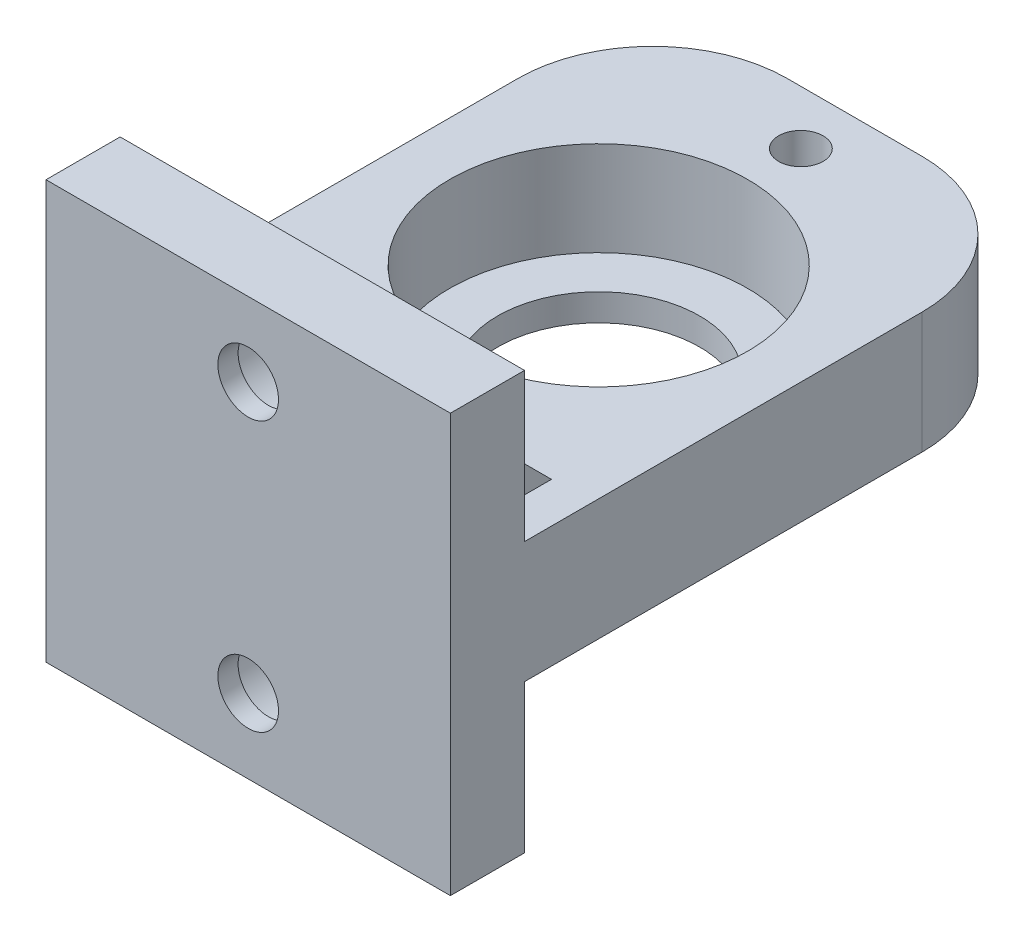
ISO-10303-21;
HEADER;
FILE_DESCRIPTION(('STEP AP214'),'2;1');
FILE_NAME('part.step','',(''),(''),'','','');
FILE_SCHEMA(('AUTOMOTIVE_DESIGN { 1 0 10303 214 1 1 1 1 }'));
ENDSEC;
DATA;
#1=APPLICATION_CONTEXT('core data for automotive mechanical design processes');
#2=APPLICATION_PROTOCOL_DEFINITION('international standard','automotive_design',2000,#1);
#3=PRODUCT_CONTEXT('',#1,'mechanical');
#4=PRODUCT('Part','Part','',(#3));
#5=PRODUCT_RELATED_PRODUCT_CATEGORY('part','',(#4));
#6=PRODUCT_DEFINITION_FORMATION('','',#4);
#7=PRODUCT_DEFINITION_CONTEXT('part definition',#1,'design');
#8=PRODUCT_DEFINITION('design','',#6,#7);
#9=PRODUCT_DEFINITION_SHAPE('','',#8);
#10=(LENGTH_UNIT() NAMED_UNIT(*) SI_UNIT(.MILLI.,.METRE.));
#11=(NAMED_UNIT(*) PLANE_ANGLE_UNIT() SI_UNIT($,.RADIAN.));
#12=(NAMED_UNIT(*) SI_UNIT($,.STERADIAN.) SOLID_ANGLE_UNIT());
#13=UNCERTAINTY_MEASURE_WITH_UNIT(LENGTH_MEASURE(1.E-05),#10,'distance_accuracy_value','');
#14=(GEOMETRIC_REPRESENTATION_CONTEXT(3) GLOBAL_UNCERTAINTY_ASSIGNED_CONTEXT((#13)) GLOBAL_UNIT_ASSIGNED_CONTEXT((#10,
#11,#12)) REPRESENTATION_CONTEXT('',''));
#15=CARTESIAN_POINT('',(0.,0.,0.));
#16=DIRECTION('',(0.,0.,1.));
#17=DIRECTION('',(1.,0.,0.));
#18=AXIS2_PLACEMENT_3D('',#15,#16,#17);
#19=CARTESIAN_POINT('',(15.,9.,-22.5));
#20=DIRECTION('',(-1.,0.,0.));
#21=DIRECTION('',(0.,0.,1.));
#22=AXIS2_PLACEMENT_3D('',#19,#20,#21);
#23=PLANE('',#22);
#24=DIRECTION('',(0.,-1.,0.));
#25=VECTOR('',#24,1.);
#26=CARTESIAN_POINT('',(15.,9.,22.5));
#27=LINE('',#26,#25);
#28=CARTESIAN_POINT('',(15.,20.,22.5));
#29=VERTEX_POINT('',#28);
#30=CARTESIAN_POINT('',(15.,-11.,22.5));
#31=VERTEX_POINT('',#30);
#32=EDGE_CURVE('E348',#29,#31,#27,.T.);
#33=ORIENTED_EDGE('',*,*,#32,.T.);
#34=DIRECTION('',(0.,0.,1.));
#35=VECTOR('',#34,1.);
#36=CARTESIAN_POINT('',(15.,-11.,17.));
#37=LINE('',#36,#35);
#38=CARTESIAN_POINT('',(15.,-11.,17.));
#39=VERTEX_POINT('',#38);
#40=EDGE_CURVE('E321',#39,#31,#37,.T.);
#41=ORIENTED_EDGE('',*,*,#40,.F.);
#42=DIRECTION('',(0.,1.,0.));
#43=VECTOR('',#42,1.);
#44=CARTESIAN_POINT('',(15.,0.,17.));
#45=LINE('',#44,#43);
#46=CARTESIAN_POINT('',(15.,0.,17.));
#47=VERTEX_POINT('',#46);
#48=EDGE_CURVE('E312',#39,#47,#45,.T.);
#49=ORIENTED_EDGE('',*,*,#48,.T.);
#50=DIRECTION('',(0.,0.,-1.));
#51=VECTOR('',#50,1.);
#52=CARTESIAN_POINT('',(15.,0.,-22.5));
#53=LINE('',#52,#51);
#54=CARTESIAN_POINT('',(15.,0.,-12.5));
#55=VERTEX_POINT('',#54);
#56=EDGE_CURVE('E336',#47,#55,#53,.T.);
#57=ORIENTED_EDGE('',*,*,#56,.T.);
#58=DIRECTION('',(0.,-1.,0.));
#59=VECTOR('',#58,1.);
#60=CARTESIAN_POINT('',(15.,9.,-12.5));
#61=LINE('',#60,#59);
#62=CARTESIAN_POINT('',(15.,9.,-12.5));
#63=VERTEX_POINT('',#62);
#64=EDGE_CURVE('E369',#55,#63,#61,.F.);
#65=ORIENTED_EDGE('',*,*,#64,.T.);
#66=DIRECTION('',(0.,0.,-1.));
#67=VECTOR('',#66,1.);
#68=CARTESIAN_POINT('',(15.,9.,-22.5));
#69=LINE('',#68,#67);
#70=CARTESIAN_POINT('',(15.,9.,17.));
#71=VERTEX_POINT('',#70);
#72=EDGE_CURVE('E339',#71,#63,#69,.T.);
#73=ORIENTED_EDGE('',*,*,#72,.F.);
#74=DIRECTION('',(0.,-1.,0.));
#75=VECTOR('',#74,1.);
#76=CARTESIAN_POINT('',(15.,20.,17.));
#77=LINE('',#76,#75);
#78=CARTESIAN_POINT('',(15.,20.,17.));
#79=VERTEX_POINT('',#78);
#80=EDGE_CURVE('E253',#79,#71,#77,.T.);
#81=ORIENTED_EDGE('',*,*,#80,.F.);
#82=DIRECTION('',(0.,0.,-1.));
#83=VECTOR('',#82,1.);
#84=CARTESIAN_POINT('',(15.,20.,17.));
#85=LINE('',#84,#83);
#86=EDGE_CURVE('E244',#29,#79,#85,.T.);
#87=ORIENTED_EDGE('',*,*,#86,.F.);
#88=EDGE_LOOP('',(#33,#41,#49,#57,#65,#73,#81,#87));
#89=FACE_BOUND('',#88,.T.);
#90=ADVANCED_FACE('F41',(#89),#23,.F.);
#91=CARTESIAN_POINT('',(-15.,9.,-22.5));
#92=DIRECTION('',(0.,0.,1.));
#93=DIRECTION('',(1.,0.,0.));
#94=AXIS2_PLACEMENT_3D('',#91,#92,#93);
#95=PLANE('',#94);
#96=DIRECTION('',(-1.,0.,0.));
#97=VECTOR('',#96,1.);
#98=CARTESIAN_POINT('',(-15.,9.,-22.5));
#99=LINE('',#98,#97);
#100=CARTESIAN_POINT('',(4.99999999999999,9.,-22.5));
#101=VERTEX_POINT('',#100);
#102=CARTESIAN_POINT('',(-5.,9.,-22.5));
#103=VERTEX_POINT('',#102);
#104=EDGE_CURVE('E341',#101,#103,#99,.T.);
#105=ORIENTED_EDGE('',*,*,#104,.F.);
#106=DIRECTION('',(0.,-1.,0.));
#107=VECTOR('',#106,1.);
#108=CARTESIAN_POINT('',(4.99999999999999,9.,-22.5));
#109=LINE('',#108,#107);
#110=CARTESIAN_POINT('',(4.99999999999999,0.,-22.5));
#111=VERTEX_POINT('',#110);
#112=EDGE_CURVE('E361',#101,#111,#109,.T.);
#113=ORIENTED_EDGE('',*,*,#112,.T.);
#114=DIRECTION('',(-1.,0.,0.));
#115=VECTOR('',#114,1.);
#116=CARTESIAN_POINT('',(-15.,0.,-22.5));
#117=LINE('',#116,#115);
#118=CARTESIAN_POINT('',(-5.,0.,-22.5));
#119=VERTEX_POINT('',#118);
#120=EDGE_CURVE('E350',#111,#119,#117,.T.);
#121=ORIENTED_EDGE('',*,*,#120,.T.);
#122=DIRECTION('',(0.,-1.,0.));
#123=VECTOR('',#122,1.);
#124=CARTESIAN_POINT('',(-5.,9.,-22.5));
#125=LINE('',#124,#123);
#126=EDGE_CURVE('E359',#119,#103,#125,.F.);
#127=ORIENTED_EDGE('',*,*,#126,.T.);
#128=EDGE_LOOP('',(#105,#113,#121,#127));
#129=FACE_BOUND('',#128,.T.);
#130=ADVANCED_FACE('F425',(#129),#95,.F.);
#131=CARTESIAN_POINT('',(-15.,9.,-22.5));
#132=DIRECTION('',(1.,0.,0.));
#133=DIRECTION('',(0.,0.,-1.));
#134=AXIS2_PLACEMENT_3D('',#131,#132,#133);
#135=PLANE('',#134);
#136=DIRECTION('',(0.,0.,1.));
#137=VECTOR('',#136,1.);
#138=CARTESIAN_POINT('',(-15.,9.,-22.5));
#139=LINE('',#138,#137);
#140=CARTESIAN_POINT('',(-15.,9.,-12.5));
#141=VERTEX_POINT('',#140);
#142=CARTESIAN_POINT('',(-15.,9.,17.));
#143=VERTEX_POINT('',#142);
#144=EDGE_CURVE('E345',#141,#143,#139,.T.);
#145=ORIENTED_EDGE('',*,*,#144,.F.);
#146=DIRECTION('',(0.,-1.,0.));
#147=VECTOR('',#146,1.);
#148=CARTESIAN_POINT('',(-15.,9.,-12.5));
#149=LINE('',#148,#147);
#150=CARTESIAN_POINT('',(-15.,0.,-12.5));
#151=VERTEX_POINT('',#150);
#152=EDGE_CURVE('E376',#141,#151,#149,.T.);
#153=ORIENTED_EDGE('',*,*,#152,.T.);
#154=DIRECTION('',(0.,0.,1.));
#155=VECTOR('',#154,1.);
#156=CARTESIAN_POINT('',(-15.,0.,-22.5));
#157=LINE('',#156,#155);
#158=CARTESIAN_POINT('',(-15.,0.,17.));
#159=VERTEX_POINT('',#158);
#160=EDGE_CURVE('E342',#151,#159,#157,.T.);
#161=ORIENTED_EDGE('',*,*,#160,.T.);
#162=DIRECTION('',(0.,-1.,0.));
#163=VECTOR('',#162,1.);
#164=CARTESIAN_POINT('',(-15.,0.,17.));
#165=LINE('',#164,#163);
#166=CARTESIAN_POINT('',(-15.,-11.,17.));
#167=VERTEX_POINT('',#166);
#168=EDGE_CURVE('E307',#159,#167,#165,.T.);
#169=ORIENTED_EDGE('',*,*,#168,.T.);
#170=DIRECTION('',(0.,0.,1.));
#171=VECTOR('',#170,1.);
#172=CARTESIAN_POINT('',(-15.,-11.,17.));
#173=LINE('',#172,#171);
#174=CARTESIAN_POINT('',(-15.,-11.,22.5));
#175=VERTEX_POINT('',#174);
#176=EDGE_CURVE('E318',#167,#175,#173,.T.);
#177=ORIENTED_EDGE('',*,*,#176,.T.);
#178=DIRECTION('',(0.,-1.,0.));
#179=VECTOR('',#178,1.);
#180=CARTESIAN_POINT('',(-15.,9.,22.5));
#181=LINE('',#180,#179);
#182=CARTESIAN_POINT('',(-15.,20.,22.5));
#183=VERTEX_POINT('',#182);
#184=EDGE_CURVE('E357',#183,#175,#181,.T.);
#185=ORIENTED_EDGE('',*,*,#184,.F.);
#186=DIRECTION('',(0.,0.,1.));
#187=VECTOR('',#186,1.);
#188=CARTESIAN_POINT('',(-15.,20.,17.));
#189=LINE('',#188,#187);
#190=CARTESIAN_POINT('',(-15.,20.,17.));
#191=VERTEX_POINT('',#190);
#192=EDGE_CURVE('E237',#191,#183,#189,.T.);
#193=ORIENTED_EDGE('',*,*,#192,.F.);
#194=DIRECTION('',(0.,-1.,0.));
#195=VECTOR('',#194,1.);
#196=CARTESIAN_POINT('',(-15.,20.,17.));
#197=LINE('',#196,#195);
#198=EDGE_CURVE('E248',#191,#143,#197,.T.);
#199=ORIENTED_EDGE('',*,*,#198,.T.);
#200=EDGE_LOOP('',(#145,#153,#161,#169,#177,#185,#193,#199));
#201=FACE_BOUND('',#200,.T.);
#202=ADVANCED_FACE('F433',(#201),#135,.F.);
#203=CARTESIAN_POINT('',(-15.,9.,22.5));
#204=DIRECTION('',(0.,0.,-1.));
#205=DIRECTION('',(-1.,0.,0.));
#206=AXIS2_PLACEMENT_3D('',#203,#204,#205);
#207=PLANE('',#206);
#208=CARTESIAN_POINT('',(0.,14.5,22.5));
#209=DIRECTION('',(0.,0.,-1.));
#210=DIRECTION('',(-1.,0.,0.));
#211=AXIS2_PLACEMENT_3D('',#208,#209,#210);
#212=CIRCLE('',#211,2.25);
#213=CARTESIAN_POINT('',(-2.25,14.5,22.5));
#214=VERTEX_POINT('',#213);
#215=EDGE_CURVE('E210',#214,#214,#212,.T.);
#216=ORIENTED_EDGE('',*,*,#215,.T.);
#217=EDGE_LOOP('',(#216));
#218=FACE_BOUND('',#217,.T.);
#219=DIRECTION('',(1.,0.,0.));
#220=VECTOR('',#219,1.);
#221=CARTESIAN_POINT('',(-15.,-11.,22.5));
#222=LINE('',#221,#220);
#223=EDGE_CURVE('E306',#175,#31,#222,.T.);
#224=ORIENTED_EDGE('',*,*,#223,.T.);
#225=ORIENTED_EDGE('',*,*,#32,.F.);
#226=DIRECTION('',(1.,0.,0.));
#227=VECTOR('',#226,1.);
#228=CARTESIAN_POINT('',(-15.,20.,22.5));
#229=LINE('',#228,#227);
#230=EDGE_CURVE('E240',#183,#29,#229,.T.);
#231=ORIENTED_EDGE('',*,*,#230,.F.);
#232=ORIENTED_EDGE('',*,*,#184,.T.);
#233=EDGE_LOOP('',(#224,#225,#231,#232));
#234=FACE_BOUND('',#233,.T.);
#235=CARTESIAN_POINT('',(0.,-5.5,22.5));
#236=DIRECTION('',(0.,0.,-1.));
#237=DIRECTION('',(-1.,0.,0.));
#238=AXIS2_PLACEMENT_3D('',#235,#236,#237);
#239=CIRCLE('',#238,2.25);
#240=CARTESIAN_POINT('',(-2.25,-5.5,22.5));
#241=VERTEX_POINT('',#240);
#242=EDGE_CURVE('E303',#241,#241,#239,.T.);
#243=ORIENTED_EDGE('',*,*,#242,.T.);
#244=EDGE_LOOP('',(#243));
#245=FACE_BOUND('',#244,.T.);
#246=ADVANCED_FACE('F485',(#218,#234,#245),#207,.F.);
#247=CARTESIAN_POINT('',(0.,9.,0.));
#248=DIRECTION('',(0.,1.,0.));
#249=DIRECTION('',(0.,0.,1.));
#250=AXIS2_PLACEMENT_3D('',#247,#248,#249);
#251=PLANE('',#250);
#252=DIRECTION('',(0.,0.,-1.));
#253=VECTOR('',#252,1.);
#254=CARTESIAN_POINT('',(12.,9.,0.));
#255=LINE('',#254,#253);
#256=CARTESIAN_POINT('',(12.,9.,17.));
#257=VERTEX_POINT('',#256);
#258=CARTESIAN_POINT('',(12.,9.,12.));
#259=VERTEX_POINT('',#258);
#260=EDGE_CURVE('E218',#257,#259,#255,.T.);
#261=ORIENTED_EDGE('',*,*,#260,.F.);
#262=DIRECTION('',(-1.,0.,0.));
#263=VECTOR('',#262,1.);
#264=CARTESIAN_POINT('',(-15.,9.,17.));
#265=LINE('',#264,#263);
#266=EDGE_CURVE('E241',#71,#257,#265,.T.);
#267=ORIENTED_EDGE('',*,*,#266,.F.);
#268=ORIENTED_EDGE('',*,*,#72,.T.);
#269=CARTESIAN_POINT('',(4.99999999999999,9.,-12.5));
#270=DIRECTION('',(0.,1.,0.));
#271=DIRECTION('',(0.,0.,1.));
#272=AXIS2_PLACEMENT_3D('',#269,#270,#271);
#273=CIRCLE('',#272,10.);
#274=EDGE_CURVE('E374',#63,#101,#273,.T.);
#275=ORIENTED_EDGE('',*,*,#274,.T.);
#276=ORIENTED_EDGE('',*,*,#104,.T.);
#277=CARTESIAN_POINT('',(-5.,9.,-12.5));
#278=DIRECTION('',(0.,1.,0.));
#279=DIRECTION('',(0.,0.,1.));
#280=AXIS2_PLACEMENT_3D('',#277,#278,#279);
#281=CIRCLE('',#280,10.);
#282=EDGE_CURVE('E372',#103,#141,#281,.T.);
#283=ORIENTED_EDGE('',*,*,#282,.T.);
#284=ORIENTED_EDGE('',*,*,#144,.T.);
#285=CARTESIAN_POINT('',(-12.,9.,17.));
#286=VERTEX_POINT('',#285);
#287=EDGE_CURVE('E236',#286,#143,#265,.T.);
#288=ORIENTED_EDGE('',*,*,#287,.F.);
#289=DIRECTION('',(0.,0.,1.));
#290=VECTOR('',#289,1.);
#291=CARTESIAN_POINT('',(-12.,9.,0.));
#292=LINE('',#291,#290);
#293=CARTESIAN_POINT('',(-12.,9.,12.));
#294=VERTEX_POINT('',#293);
#295=EDGE_CURVE('E230',#294,#286,#292,.T.);
#296=ORIENTED_EDGE('',*,*,#295,.F.);
#297=DIRECTION('',(1.,0.,0.));
#298=VECTOR('',#297,1.);
#299=CARTESIAN_POINT('',(0.,9.,12.));
#300=LINE('',#299,#298);
#301=CARTESIAN_POINT('',(-7.99999999999999,9.,12.));
#302=VERTEX_POINT('',#301);
#303=EDGE_CURVE('E233',#302,#294,#300,.F.);
#304=ORIENTED_EDGE('',*,*,#303,.F.);
#305=DIRECTION('',(0.,0.,1.));
#306=VECTOR('',#305,1.);
#307=CARTESIAN_POINT('',(-7.99999999999999,9.,0.));
#308=LINE('',#307,#306);
#309=CARTESIAN_POINT('',(-7.99999999999999,9.,17.));
#310=VERTEX_POINT('',#309);
#311=EDGE_CURVE('E225',#302,#310,#308,.T.);
#312=ORIENTED_EDGE('',*,*,#311,.T.);
#313=CARTESIAN_POINT('',(7.99999999999999,9.,17.));
#314=VERTEX_POINT('',#313);
#315=EDGE_CURVE('E250',#314,#310,#265,.T.);
#316=ORIENTED_EDGE('',*,*,#315,.F.);
#317=DIRECTION('',(0.,0.,-1.));
#318=VECTOR('',#317,1.);
#319=CARTESIAN_POINT('',(7.99999999999999,9.,0.));
#320=LINE('',#319,#318);
#321=CARTESIAN_POINT('',(7.99999999999999,9.,12.));
#322=VERTEX_POINT('',#321);
#323=EDGE_CURVE('E61',#314,#322,#320,.T.);
#324=ORIENTED_EDGE('',*,*,#323,.T.);
#325=DIRECTION('',(-1.,0.,0.));
#326=VECTOR('',#325,1.);
#327=CARTESIAN_POINT('',(0.,9.,12.));
#328=LINE('',#327,#326);
#329=EDGE_CURVE('E56',#259,#322,#328,.T.);
#330=ORIENTED_EDGE('',*,*,#329,.F.);
#331=EDGE_LOOP('',(#261,#267,#268,#275,#276,#283,#284,#288,#296,#304,#312,#316,#324,#330));
#332=FACE_BOUND('',#331,.T.);
#333=CARTESIAN_POINT('',(0.,9.,-18.5));
#334=DIRECTION('',(0.,1.,0.));
#335=DIRECTION('',(0.,0.,1.));
#336=AXIS2_PLACEMENT_3D('',#333,#334,#335);
#337=CIRCLE('',#336,1.65);
#338=CARTESIAN_POINT('',(0.,9.,-16.85));
#339=VERTEX_POINT('',#338);
#340=EDGE_CURVE('E256',#339,#339,#337,.T.);
#341=ORIENTED_EDGE('',*,*,#340,.F.);
#342=EDGE_LOOP('',(#341));
#343=FACE_BOUND('',#342,.T.);
#344=CARTESIAN_POINT('',(0.,9.,11.5));
#345=DIRECTION('',(0.,1.,0.));
#346=DIRECTION('',(0.,0.,1.));
#347=AXIS2_PLACEMENT_3D('',#344,#345,#346);
#348=CIRCLE('',#347,1.65);
#349=CARTESIAN_POINT('',(0.,9.,13.15));
#350=VERTEX_POINT('',#349);
#351=EDGE_CURVE('E262',#350,#350,#348,.T.);
#352=ORIENTED_EDGE('',*,*,#351,.F.);
#353=EDGE_LOOP('',(#352));
#354=FACE_BOUND('',#353,.T.);
#355=CARTESIAN_POINT('',(0.,9.,-3.49999999999999));
#356=DIRECTION('',(0.,1.,0.));
#357=DIRECTION('',(0.,0.,1.));
#358=AXIS2_PLACEMENT_3D('',#355,#356,#357);
#359=CIRCLE('',#358,11.05);
#360=CARTESIAN_POINT('',(0.,9.,7.55000000000001));
#361=VERTEX_POINT('',#360);
#362=EDGE_CURVE('E330',#361,#361,#359,.T.);
#363=ORIENTED_EDGE('',*,*,#362,.F.);
#364=EDGE_LOOP('',(#363));
#365=FACE_BOUND('',#364,.T.);
#366=ADVANCED_FACE('F404',(#332,#343,#354,#365),#251,.T.);
#367=CARTESIAN_POINT('',(0.,0.,0.));
#368=DIRECTION('',(0.,1.,0.));
#369=DIRECTION('',(0.,0.,1.));
#370=AXIS2_PLACEMENT_3D('',#367,#368,#369);
#371=PLANE('',#370);
#372=DIRECTION('',(0.,0.,-1.));
#373=VECTOR('',#372,1.);
#374=CARTESIAN_POINT('',(12.,0.,0.));
#375=LINE('',#374,#373);
#376=CARTESIAN_POINT('',(12.,0.,17.));
#377=VERTEX_POINT('',#376);
#378=CARTESIAN_POINT('',(12.,0.,12.));
#379=VERTEX_POINT('',#378);
#380=EDGE_CURVE('E277',#377,#379,#375,.T.);
#381=ORIENTED_EDGE('',*,*,#380,.T.);
#382=DIRECTION('',(1.,0.,0.));
#383=VECTOR('',#382,1.);
#384=CARTESIAN_POINT('',(0.,0.,12.));
#385=LINE('',#384,#383);
#386=CARTESIAN_POINT('',(7.99999999999999,0.,12.));
#387=VERTEX_POINT('',#386);
#388=EDGE_CURVE('E279',#379,#387,#385,.F.);
#389=ORIENTED_EDGE('',*,*,#388,.T.);
#390=DIRECTION('',(0.,0.,-1.));
#391=VECTOR('',#390,1.);
#392=CARTESIAN_POINT('',(7.99999999999999,0.,0.));
#393=LINE('',#392,#391);
#394=CARTESIAN_POINT('',(7.99999999999999,0.,17.));
#395=VERTEX_POINT('',#394);
#396=EDGE_CURVE('E272',#395,#387,#393,.T.);
#397=ORIENTED_EDGE('',*,*,#396,.F.);
#398=DIRECTION('',(-1.,0.,0.));
#399=VECTOR('',#398,1.);
#400=CARTESIAN_POINT('',(-15.,0.,17.));
#401=LINE('',#400,#399);
#402=CARTESIAN_POINT('',(-7.99999999999999,0.,17.));
#403=VERTEX_POINT('',#402);
#404=EDGE_CURVE('E319',#395,#403,#401,.T.);
#405=ORIENTED_EDGE('',*,*,#404,.T.);
#406=DIRECTION('',(0.,0.,1.));
#407=VECTOR('',#406,1.);
#408=CARTESIAN_POINT('',(-7.99999999999999,0.,0.));
#409=LINE('',#408,#407);
#410=CARTESIAN_POINT('',(-7.99999999999999,0.,12.));
#411=VERTEX_POINT('',#410);
#412=EDGE_CURVE('E285',#411,#403,#409,.T.);
#413=ORIENTED_EDGE('',*,*,#412,.F.);
#414=DIRECTION('',(-1.,0.,0.));
#415=VECTOR('',#414,1.);
#416=CARTESIAN_POINT('',(0.,0.,12.));
#417=LINE('',#416,#415);
#418=CARTESIAN_POINT('',(-12.,0.,12.));
#419=VERTEX_POINT('',#418);
#420=EDGE_CURVE('E292',#411,#419,#417,.T.);
#421=ORIENTED_EDGE('',*,*,#420,.T.);
#422=DIRECTION('',(0.,0.,1.));
#423=VECTOR('',#422,1.);
#424=CARTESIAN_POINT('',(-12.,0.,0.));
#425=LINE('',#424,#423);
#426=CARTESIAN_POINT('',(-12.,0.,17.));
#427=VERTEX_POINT('',#426);
#428=EDGE_CURVE('E290',#419,#427,#425,.T.);
#429=ORIENTED_EDGE('',*,*,#428,.T.);
#430=EDGE_CURVE('E314',#427,#159,#401,.T.);
#431=ORIENTED_EDGE('',*,*,#430,.T.);
#432=ORIENTED_EDGE('',*,*,#160,.F.);
#433=CARTESIAN_POINT('',(-5.,0.,-12.5));
#434=DIRECTION('',(0.,1.,0.));
#435=DIRECTION('',(0.,0.,1.));
#436=AXIS2_PLACEMENT_3D('',#433,#434,#435);
#437=CIRCLE('',#436,10.);
#438=EDGE_CURVE('E364',#151,#119,#437,.F.);
#439=ORIENTED_EDGE('',*,*,#438,.T.);
#440=ORIENTED_EDGE('',*,*,#120,.F.);
#441=CARTESIAN_POINT('',(4.99999999999999,0.,-12.5));
#442=DIRECTION('',(0.,1.,0.));
#443=DIRECTION('',(0.,0.,1.));
#444=AXIS2_PLACEMENT_3D('',#441,#442,#443);
#445=CIRCLE('',#444,10.);
#446=EDGE_CURVE('E366',#111,#55,#445,.F.);
#447=ORIENTED_EDGE('',*,*,#446,.T.);
#448=ORIENTED_EDGE('',*,*,#56,.F.);
#449=EDGE_CURVE('E315',#47,#377,#401,.T.);
#450=ORIENTED_EDGE('',*,*,#449,.T.);
#451=EDGE_LOOP('',(#381,#389,#397,#405,#413,#421,#429,#431,#432,#439,#440,#447,#448,#450));
#452=FACE_BOUND('',#451,.T.);
#453=CARTESIAN_POINT('',(0.,0.,-3.49999999999999));
#454=DIRECTION('',(0.,1.,0.));
#455=DIRECTION('',(0.,0.,1.));
#456=AXIS2_PLACEMENT_3D('',#453,#454,#455);
#457=CIRCLE('',#456,7.5);
#458=CARTESIAN_POINT('',(0.,0.,4.00000000000001));
#459=VERTEX_POINT('',#458);
#460=EDGE_CURVE('E327',#459,#459,#457,.T.);
#461=ORIENTED_EDGE('',*,*,#460,.T.);
#462=EDGE_LOOP('',(#461));
#463=FACE_BOUND('',#462,.T.);
#464=ADVANCED_FACE('F473',(#452,#463),#371,.F.);
#465=CARTESIAN_POINT('',(0.,2.,-3.49999999999999));
#466=DIRECTION('',(0.,1.,0.));
#467=DIRECTION('',(0.,0.,1.));
#468=AXIS2_PLACEMENT_3D('',#465,#466,#467);
#469=CYLINDRICAL_SURFACE('',#468,11.05);
#470=ORIENTED_EDGE('',*,*,#362,.T.);
#471=EDGE_LOOP('',(#470));
#472=FACE_BOUND('',#471,.T.);
#473=CARTESIAN_POINT('',(0.,2.,-3.49999999999999));
#474=DIRECTION('',(0.,1.,0.));
#475=DIRECTION('',(0.,0.,1.));
#476=AXIS2_PLACEMENT_3D('',#473,#474,#475);
#477=CIRCLE('',#476,11.05);
#478=CARTESIAN_POINT('',(0.,2.,7.55000000000001));
#479=VERTEX_POINT('',#478);
#480=EDGE_CURVE('E333',#479,#479,#477,.T.);
#481=ORIENTED_EDGE('',*,*,#480,.F.);
#482=EDGE_LOOP('',(#481));
#483=FACE_BOUND('',#482,.T.);
#484=ADVANCED_FACE('F520',(#472,#483),#469,.F.);
#485=CARTESIAN_POINT('',(0.,2.,-3.49999999999999));
#486=DIRECTION('',(0.,1.,0.));
#487=DIRECTION('',(0.,0.,1.));
#488=AXIS2_PLACEMENT_3D('',#485,#486,#487);
#489=PLANE('',#488);
#490=CARTESIAN_POINT('',(0.,2.,-3.49999999999999));
#491=DIRECTION('',(0.,1.,0.));
#492=DIRECTION('',(0.,0.,1.));
#493=AXIS2_PLACEMENT_3D('',#490,#491,#492);
#494=CIRCLE('',#493,7.5);
#495=CARTESIAN_POINT('',(0.,2.,4.00000000000001));
#496=VERTEX_POINT('',#495);
#497=EDGE_CURVE('E324',#496,#496,#494,.T.);
#498=ORIENTED_EDGE('',*,*,#497,.F.);
#499=EDGE_LOOP('',(#498));
#500=FACE_BOUND('',#499,.T.);
#501=ORIENTED_EDGE('',*,*,#480,.T.);
#502=EDGE_LOOP('',(#501));
#503=FACE_BOUND('',#502,.T.);
#504=ADVANCED_FACE('F447',(#500,#503),#489,.T.);
#505=CARTESIAN_POINT('',(0.,0.,-3.49999999999999));
#506=DIRECTION('',(0.,1.,0.));
#507=DIRECTION('',(0.,0.,1.));
#508=AXIS2_PLACEMENT_3D('',#505,#506,#507);
#509=CYLINDRICAL_SURFACE('',#508,7.5);
#510=ORIENTED_EDGE('',*,*,#460,.F.);
#511=EDGE_LOOP('',(#510));
#512=FACE_BOUND('',#511,.T.);
#513=ORIENTED_EDGE('',*,*,#497,.T.);
#514=EDGE_LOOP('',(#513));
#515=FACE_BOUND('',#514,.T.);
#516=ADVANCED_FACE('F439',(#512,#515),#509,.F.);
#517=CARTESIAN_POINT('',(4.99999999999999,9.,-12.5));
#518=DIRECTION('',(0.,-1.,0.));
#519=DIRECTION('',(0.,0.,-1.));
#520=AXIS2_PLACEMENT_3D('',#517,#518,#519);
#521=CYLINDRICAL_SURFACE('',#520,10.);
#522=ORIENTED_EDGE('',*,*,#274,.F.);
#523=ORIENTED_EDGE('',*,*,#64,.F.);
#524=ORIENTED_EDGE('',*,*,#446,.F.);
#525=ORIENTED_EDGE('',*,*,#112,.F.);
#526=EDGE_LOOP('',(#522,#523,#524,#525));
#527=FACE_BOUND('',#526,.T.);
#528=ADVANCED_FACE('F437',(#527),#521,.T.);
#529=CARTESIAN_POINT('',(-5.,9.,-12.5));
#530=DIRECTION('',(0.,-1.,0.));
#531=DIRECTION('',(0.,0.,-1.));
#532=AXIS2_PLACEMENT_3D('',#529,#530,#531);
#533=CYLINDRICAL_SURFACE('',#532,10.);
#534=ORIENTED_EDGE('',*,*,#282,.F.);
#535=ORIENTED_EDGE('',*,*,#126,.F.);
#536=ORIENTED_EDGE('',*,*,#438,.F.);
#537=ORIENTED_EDGE('',*,*,#152,.F.);
#538=EDGE_LOOP('',(#534,#535,#536,#537));
#539=FACE_BOUND('',#538,.T.);
#540=ADVANCED_FACE('F43',(#539),#533,.T.);
#541=CARTESIAN_POINT('',(-15.,-11.,17.));
#542=DIRECTION('',(0.,-1.,0.));
#543=DIRECTION('',(0.,0.,-1.));
#544=AXIS2_PLACEMENT_3D('',#541,#542,#543);
#545=PLANE('',#544);
#546=ORIENTED_EDGE('',*,*,#40,.T.);
#547=ORIENTED_EDGE('',*,*,#223,.F.);
#548=ORIENTED_EDGE('',*,*,#176,.F.);
#549=DIRECTION('',(1.,0.,0.));
#550=VECTOR('',#549,1.);
#551=CARTESIAN_POINT('',(-15.,-11.,17.));
#552=LINE('',#551,#550);
#553=EDGE_CURVE('E310',#167,#39,#552,.T.);
#554=ORIENTED_EDGE('',*,*,#553,.T.);
#555=EDGE_LOOP('',(#546,#547,#548,#554));
#556=FACE_BOUND('',#555,.T.);
#557=ADVANCED_FACE('F444',(#556),#545,.T.);
#558=CARTESIAN_POINT('',(0.,0.,17.));
#559=DIRECTION('',(0.,0.,1.));
#560=DIRECTION('',(1.,0.,0.));
#561=AXIS2_PLACEMENT_3D('',#558,#559,#560);
#562=PLANE('',#561);
#563=ORIENTED_EDGE('',*,*,#48,.F.);
#564=ORIENTED_EDGE('',*,*,#553,.F.);
#565=ORIENTED_EDGE('',*,*,#168,.F.);
#566=ORIENTED_EDGE('',*,*,#430,.F.);
#567=DIRECTION('',(0.,-1.,0.));
#568=VECTOR('',#567,1.);
#569=CARTESIAN_POINT('',(-12.,0.,17.));
#570=LINE('',#569,#568);
#571=CARTESIAN_POINT('',(-12.,-5.00000000000002,17.));
#572=VERTEX_POINT('',#571);
#573=EDGE_CURVE('E384',#427,#572,#570,.T.);
#574=ORIENTED_EDGE('',*,*,#573,.T.);
#575=DIRECTION('',(1.,0.,0.));
#576=VECTOR('',#575,1.);
#577=CARTESIAN_POINT('',(0.,-5.00000000000002,17.));
#578=LINE('',#577,#576);
#579=CARTESIAN_POINT('',(-7.99999999999999,-5.00000000000002,17.));
#580=VERTEX_POINT('',#579);
#581=EDGE_CURVE('E382',#572,#580,#578,.T.);
#582=ORIENTED_EDGE('',*,*,#581,.T.);
#583=DIRECTION('',(0.,-1.,0.));
#584=VECTOR('',#583,1.);
#585=CARTESIAN_POINT('',(-7.99999999999999,0.,17.));
#586=LINE('',#585,#584);
#587=EDGE_CURVE('E379',#403,#580,#586,.T.);
#588=ORIENTED_EDGE('',*,*,#587,.F.);
#589=ORIENTED_EDGE('',*,*,#404,.F.);
#590=DIRECTION('',(0.,1.,0.));
#591=VECTOR('',#590,1.);
#592=CARTESIAN_POINT('',(7.99999999999999,0.,17.));
#593=LINE('',#592,#591);
#594=CARTESIAN_POINT('',(7.99999999999999,-5.00000000000002,17.));
#595=VERTEX_POINT('',#594);
#596=EDGE_CURVE('E386',#595,#395,#593,.T.);
#597=ORIENTED_EDGE('',*,*,#596,.F.);
#598=DIRECTION('',(-1.,0.,0.));
#599=VECTOR('',#598,1.);
#600=CARTESIAN_POINT('',(0.,-5.00000000000002,17.));
#601=LINE('',#600,#599);
#602=CARTESIAN_POINT('',(12.,-5.00000000000002,17.));
#603=VERTEX_POINT('',#602);
#604=EDGE_CURVE('E389',#595,#603,#601,.F.);
#605=ORIENTED_EDGE('',*,*,#604,.T.);
#606=DIRECTION('',(0.,1.,0.));
#607=VECTOR('',#606,1.);
#608=CARTESIAN_POINT('',(12.,0.,17.));
#609=LINE('',#608,#607);
#610=EDGE_CURVE('E391',#603,#377,#609,.T.);
#611=ORIENTED_EDGE('',*,*,#610,.T.);
#612=ORIENTED_EDGE('',*,*,#449,.F.);
#613=EDGE_LOOP('',(#563,#564,#565,#566,#574,#582,#588,#589,#597,#605,#611,#612));
#614=FACE_BOUND('',#613,.T.);
#615=CARTESIAN_POINT('',(0.,-5.5,17.));
#616=DIRECTION('',(0.,0.,-1.));
#617=DIRECTION('',(-1.,0.,0.));
#618=AXIS2_PLACEMENT_3D('',#615,#616,#617);
#619=CIRCLE('',#618,4.);
#620=CARTESIAN_POINT('',(-4.,-5.5,17.));
#621=VERTEX_POINT('',#620);
#622=EDGE_CURVE('E294',#621,#621,#619,.T.);
#623=ORIENTED_EDGE('',*,*,#622,.F.);
#624=EDGE_LOOP('',(#623));
#625=FACE_BOUND('',#624,.T.);
#626=ADVANCED_FACE('F480',(#614,#625),#562,.F.);
#627=CARTESIAN_POINT('',(0.,-5.5,17.));
#628=DIRECTION('',(0.,0.,-1.));
#629=DIRECTION('',(-1.,0.,0.));
#630=AXIS2_PLACEMENT_3D('',#627,#628,#629);
#631=CYLINDRICAL_SURFACE('',#630,2.25);
#632=ORIENTED_EDGE('',*,*,#242,.F.);
#633=EDGE_LOOP('',(#632));
#634=FACE_BOUND('',#633,.T.);
#635=CARTESIAN_POINT('',(0.,-5.5,21.));
#636=DIRECTION('',(0.,0.,-1.));
#637=DIRECTION('',(-1.,0.,0.));
#638=AXIS2_PLACEMENT_3D('',#635,#636,#637);
#639=CIRCLE('',#638,2.25);
#640=CARTESIAN_POINT('',(-2.25,-5.5,21.));
#641=VERTEX_POINT('',#640);
#642=EDGE_CURVE('E300',#641,#641,#639,.T.);
#643=ORIENTED_EDGE('',*,*,#642,.T.);
#644=EDGE_LOOP('',(#643));
#645=FACE_BOUND('',#644,.T.);
#646=ADVANCED_FACE('F492',(#634,#645),#631,.F.);
#647=CARTESIAN_POINT('',(2.25,-5.5,21.));
#648=DIRECTION('',(0.,0.,1.));
#649=DIRECTION('',(1.,0.,0.));
#650=AXIS2_PLACEMENT_3D('',#647,#648,#649);
#651=PLANE('',#650);
#652=ORIENTED_EDGE('',*,*,#642,.F.);
#653=EDGE_LOOP('',(#652));
#654=FACE_BOUND('',#653,.T.);
#655=CARTESIAN_POINT('',(0.,-5.5,21.));
#656=DIRECTION('',(0.,0.,-1.));
#657=DIRECTION('',(-1.,0.,0.));
#658=AXIS2_PLACEMENT_3D('',#655,#656,#657);
#659=CIRCLE('',#658,4.);
#660=CARTESIAN_POINT('',(-4.,-5.5,21.));
#661=VERTEX_POINT('',#660);
#662=EDGE_CURVE('E297',#661,#661,#659,.T.);
#663=ORIENTED_EDGE('',*,*,#662,.T.);
#664=EDGE_LOOP('',(#663));
#665=FACE_BOUND('',#664,.T.);
#666=ADVANCED_FACE('F495',(#654,#665),#651,.F.);
#667=CARTESIAN_POINT('',(0.,-5.5,17.));
#668=DIRECTION('',(0.,0.,-1.));
#669=DIRECTION('',(-1.,0.,0.));
#670=AXIS2_PLACEMENT_3D('',#667,#668,#669);
#671=CYLINDRICAL_SURFACE('',#670,4.);
#672=ORIENTED_EDGE('',*,*,#662,.F.);
#673=EDGE_LOOP('',(#672));
#674=FACE_BOUND('',#673,.T.);
#675=ORIENTED_EDGE('',*,*,#622,.T.);
#676=EDGE_LOOP('',(#675));
#677=FACE_BOUND('',#676,.T.);
#678=ADVANCED_FACE('F501',(#674,#677),#671,.F.);
#679=CARTESIAN_POINT('',(-9.99999999999999,0.,12.));
#680=DIRECTION('',(0.,-0.707106781186548,-0.707106781186547));
#681=DIRECTION('',(0.,-0.707106781186547,0.707106781186548));
#682=AXIS2_PLACEMENT_3D('',#679,#680,#681);
#683=PLANE('',#682);
#684=ORIENTED_EDGE('',*,*,#420,.F.);
#685=DIRECTION('',(0.,-0.707106781186547,0.707106781186548));
#686=VECTOR('',#685,1.);
#687=CARTESIAN_POINT('',(-7.99999999999999,0.,12.));
#688=LINE('',#687,#686);
#689=EDGE_CURVE('E281',#411,#580,#688,.T.);
#690=ORIENTED_EDGE('',*,*,#689,.T.);
#691=ORIENTED_EDGE('',*,*,#581,.F.);
#692=DIRECTION('',(0.,-0.707106781186547,0.707106781186548));
#693=VECTOR('',#692,1.);
#694=CARTESIAN_POINT('',(-12.,0.,12.));
#695=LINE('',#694,#693);
#696=EDGE_CURVE('E282',#419,#572,#695,.T.);
#697=ORIENTED_EDGE('',*,*,#696,.F.);
#698=EDGE_LOOP('',(#684,#690,#691,#697));
#699=FACE_BOUND('',#698,.T.);
#700=ADVANCED_FACE('F507',(#699),#683,.T.);
#701=CARTESIAN_POINT('',(-12.,-1.,0.));
#702=DIRECTION('',(-1.,0.,0.));
#703=DIRECTION('',(0.,0.,1.));
#704=AXIS2_PLACEMENT_3D('',#701,#702,#703);
#705=PLANE('',#704);
#706=ORIENTED_EDGE('',*,*,#573,.F.);
#707=ORIENTED_EDGE('',*,*,#428,.F.);
#708=ORIENTED_EDGE('',*,*,#696,.T.);
#709=EDGE_LOOP('',(#706,#707,#708));
#710=FACE_BOUND('',#709,.T.);
#711=ADVANCED_FACE('F593',(#710),#705,.T.);
#712=CARTESIAN_POINT('',(-7.99999999999999,-1.,0.));
#713=DIRECTION('',(-1.,0.,0.));
#714=DIRECTION('',(0.,0.,1.));
#715=AXIS2_PLACEMENT_3D('',#712,#713,#714);
#716=PLANE('',#715);
#717=ORIENTED_EDGE('',*,*,#689,.F.);
#718=ORIENTED_EDGE('',*,*,#412,.T.);
#719=ORIENTED_EDGE('',*,*,#587,.T.);
#720=EDGE_LOOP('',(#717,#718,#719));
#721=FACE_BOUND('',#720,.T.);
#722=ADVANCED_FACE('F603',(#721),#716,.F.);
#723=CARTESIAN_POINT('',(9.99999999999999,0.,12.));
#724=DIRECTION('',(0.,0.707106781186548,0.707106781186547));
#725=DIRECTION('',(0.,-0.707106781186547,0.707106781186548));
#726=AXIS2_PLACEMENT_3D('',#723,#724,#725);
#727=PLANE('',#726);
#728=ORIENTED_EDGE('',*,*,#388,.F.);
#729=DIRECTION('',(0.,-0.707106781186547,0.707106781186548));
#730=VECTOR('',#729,1.);
#731=CARTESIAN_POINT('',(12.,0.,12.));
#732=LINE('',#731,#730);
#733=EDGE_CURVE('E269',#379,#603,#732,.T.);
#734=ORIENTED_EDGE('',*,*,#733,.T.);
#735=ORIENTED_EDGE('',*,*,#604,.F.);
#736=DIRECTION('',(0.,-0.707106781186547,0.707106781186548));
#737=VECTOR('',#736,1.);
#738=CARTESIAN_POINT('',(7.99999999999999,0.,12.));
#739=LINE('',#738,#737);
#740=EDGE_CURVE('E268',#387,#595,#739,.T.);
#741=ORIENTED_EDGE('',*,*,#740,.F.);
#742=EDGE_LOOP('',(#728,#734,#735,#741));
#743=FACE_BOUND('',#742,.T.);
#744=ADVANCED_FACE('F613',(#743),#727,.F.);
#745=CARTESIAN_POINT('',(12.,-1.,0.));
#746=DIRECTION('',(1.,0.,0.));
#747=DIRECTION('',(0.,0.,-1.));
#748=AXIS2_PLACEMENT_3D('',#745,#746,#747);
#749=PLANE('',#748);
#750=ORIENTED_EDGE('',*,*,#380,.F.);
#751=ORIENTED_EDGE('',*,*,#610,.F.);
#752=ORIENTED_EDGE('',*,*,#733,.F.);
#753=EDGE_LOOP('',(#750,#751,#752));
#754=FACE_BOUND('',#753,.T.);
#755=ADVANCED_FACE('F623',(#754),#749,.T.);
#756=CARTESIAN_POINT('',(7.99999999999999,-1.,0.));
#757=DIRECTION('',(1.,0.,0.));
#758=DIRECTION('',(0.,0.,-1.));
#759=AXIS2_PLACEMENT_3D('',#756,#757,#758);
#760=PLANE('',#759);
#761=ORIENTED_EDGE('',*,*,#596,.T.);
#762=ORIENTED_EDGE('',*,*,#396,.T.);
#763=ORIENTED_EDGE('',*,*,#740,.T.);
#764=EDGE_LOOP('',(#761,#762,#763));
#765=FACE_BOUND('',#764,.T.);
#766=ADVANCED_FACE('F633',(#765),#760,.F.);
#767=CARTESIAN_POINT('',(0.,4.,11.5));
#768=DIRECTION('',(0.,1.,0.));
#769=DIRECTION('',(0.,0.,1.));
#770=AXIS2_PLACEMENT_3D('',#767,#768,#769);
#771=CONICAL_SURFACE('',#770,1.65,1.02974425867665);
#772=CARTESIAN_POINT('',(0.,3.00857997860452,11.5));
#773=VERTEX_POINT('',#772);
#774=VERTEX_LOOP('',#773);
#775=FACE_BOUND('',#774,.T.);
#776=CARTESIAN_POINT('',(0.,4.,11.5));
#777=DIRECTION('',(0.,1.,0.));
#778=DIRECTION('',(0.,0.,1.));
#779=AXIS2_PLACEMENT_3D('',#776,#777,#778);
#780=CIRCLE('',#779,1.65);
#781=CARTESIAN_POINT('',(0.,4.,13.15));
#782=VERTEX_POINT('',#781);
#783=EDGE_CURVE('E265',#782,#782,#780,.T.);
#784=ORIENTED_EDGE('',*,*,#783,.T.);
#785=EDGE_LOOP('',(#784));
#786=FACE_BOUND('',#785,.T.);
#787=ADVANCED_FACE('F643',(#775,#786),#771,.F.);
#788=CARTESIAN_POINT('',(0.,9.,11.5));
#789=DIRECTION('',(0.,1.,0.));
#790=DIRECTION('',(0.,0.,1.));
#791=AXIS2_PLACEMENT_3D('',#788,#789,#790);
#792=CYLINDRICAL_SURFACE('',#791,1.65);
#793=ORIENTED_EDGE('',*,*,#783,.F.);
#794=EDGE_LOOP('',(#793));
#795=FACE_BOUND('',#794,.T.);
#796=ORIENTED_EDGE('',*,*,#351,.T.);
#797=EDGE_LOOP('',(#796));
#798=FACE_BOUND('',#797,.T.);
#799=ADVANCED_FACE('F653',(#795,#798),#792,.F.);
#800=CARTESIAN_POINT('',(0.,4.,-18.5));
#801=DIRECTION('',(0.,1.,0.));
#802=DIRECTION('',(0.,0.,1.));
#803=AXIS2_PLACEMENT_3D('',#800,#801,#802);
#804=CONICAL_SURFACE('',#803,1.65,1.02974425867665);
#805=CARTESIAN_POINT('',(0.,3.00857997860452,-18.5));
#806=VERTEX_POINT('',#805);
#807=VERTEX_LOOP('',#806);
#808=FACE_BOUND('',#807,.T.);
#809=CARTESIAN_POINT('',(0.,4.,-18.5));
#810=DIRECTION('',(0.,1.,0.));
#811=DIRECTION('',(0.,0.,1.));
#812=AXIS2_PLACEMENT_3D('',#809,#810,#811);
#813=CIRCLE('',#812,1.65);
#814=CARTESIAN_POINT('',(0.,4.,-16.85));
#815=VERTEX_POINT('',#814);
#816=EDGE_CURVE('E259',#815,#815,#813,.T.);
#817=ORIENTED_EDGE('',*,*,#816,.T.);
#818=EDGE_LOOP('',(#817));
#819=FACE_BOUND('',#818,.T.);
#820=ADVANCED_FACE('F663',(#808,#819),#804,.F.);
#821=CARTESIAN_POINT('',(0.,9.,-18.5));
#822=DIRECTION('',(0.,1.,0.));
#823=DIRECTION('',(0.,0.,1.));
#824=AXIS2_PLACEMENT_3D('',#821,#822,#823);
#825=CYLINDRICAL_SURFACE('',#824,1.65);
#826=ORIENTED_EDGE('',*,*,#816,.F.);
#827=EDGE_LOOP('',(#826));
#828=FACE_BOUND('',#827,.T.);
#829=ORIENTED_EDGE('',*,*,#340,.T.);
#830=EDGE_LOOP('',(#829));
#831=FACE_BOUND('',#830,.T.);
#832=ADVANCED_FACE('F673',(#828,#831),#825,.F.);
#833=CARTESIAN_POINT('',(-15.,20.,17.));
#834=DIRECTION('',(0.,0.,1.));
#835=DIRECTION('',(1.,0.,0.));
#836=AXIS2_PLACEMENT_3D('',#833,#834,#835);
#837=PLANE('',#836);
#838=CARTESIAN_POINT('',(0.,14.5,17.));
#839=DIRECTION('',(0.,0.,-1.));
#840=DIRECTION('',(-1.,0.,0.));
#841=AXIS2_PLACEMENT_3D('',#838,#839,#840);
#842=CIRCLE('',#841,4.);
#843=CARTESIAN_POINT('',(-4.,14.5,17.));
#844=VERTEX_POINT('',#843);
#845=EDGE_CURVE('E824',#844,#844,#842,.T.);
#846=ORIENTED_EDGE('',*,*,#845,.F.);
#847=EDGE_LOOP('',(#846));
#848=FACE_BOUND('',#847,.T.);
#849=ORIENTED_EDGE('',*,*,#266,.T.);
#850=DIRECTION('',(0.,1.,0.));
#851=VECTOR('',#850,1.);
#852=CARTESIAN_POINT('',(12.,20.,17.));
#853=LINE('',#852,#851);
#854=CARTESIAN_POINT('',(12.,14.,17.));
#855=VERTEX_POINT('',#854);
#856=EDGE_CURVE('E11',#257,#855,#853,.T.);
#857=ORIENTED_EDGE('',*,*,#856,.T.);
#858=DIRECTION('',(-1.,0.,0.));
#859=VECTOR('',#858,1.);
#860=CARTESIAN_POINT('',(-15.,14.,17.));
#861=LINE('',#860,#859);
#862=CARTESIAN_POINT('',(7.99999999999999,14.,17.));
#863=VERTEX_POINT('',#862);
#864=EDGE_CURVE('E49',#855,#863,#861,.T.);
#865=ORIENTED_EDGE('',*,*,#864,.T.);
#866=DIRECTION('',(0.,1.,0.));
#867=VECTOR('',#866,1.);
#868=CARTESIAN_POINT('',(7.99999999999999,20.,17.));
#869=LINE('',#868,#867);
#870=EDGE_CURVE('E196',#314,#863,#869,.T.);
#871=ORIENTED_EDGE('',*,*,#870,.F.);
#872=ORIENTED_EDGE('',*,*,#315,.T.);
#873=DIRECTION('',(0.,-1.,0.));
#874=VECTOR('',#873,1.);
#875=CARTESIAN_POINT('',(-7.99999999999999,20.,17.));
#876=LINE('',#875,#874);
#877=CARTESIAN_POINT('',(-7.99999999999999,14.,17.));
#878=VERTEX_POINT('',#877);
#879=EDGE_CURVE('E393',#878,#310,#876,.T.);
#880=ORIENTED_EDGE('',*,*,#879,.F.);
#881=DIRECTION('',(1.,0.,0.));
#882=VECTOR('',#881,1.);
#883=CARTESIAN_POINT('',(-15.,14.,17.));
#884=LINE('',#883,#882);
#885=CARTESIAN_POINT('',(-12.,14.,17.));
#886=VERTEX_POINT('',#885);
#887=EDGE_CURVE('E396',#878,#886,#884,.F.);
#888=ORIENTED_EDGE('',*,*,#887,.T.);
#889=DIRECTION('',(0.,-1.,0.));
#890=VECTOR('',#889,1.);
#891=CARTESIAN_POINT('',(-12.,20.,17.));
#892=LINE('',#891,#890);
#893=EDGE_CURVE('E206',#886,#286,#892,.T.);
#894=ORIENTED_EDGE('',*,*,#893,.T.);
#895=ORIENTED_EDGE('',*,*,#287,.T.);
#896=ORIENTED_EDGE('',*,*,#198,.F.);
#897=DIRECTION('',(-1.,0.,0.));
#898=VECTOR('',#897,1.);
#899=CARTESIAN_POINT('',(-15.,20.,17.));
#900=LINE('',#899,#898);
#901=EDGE_CURVE('E246',#79,#191,#900,.T.);
#902=ORIENTED_EDGE('',*,*,#901,.F.);
#903=ORIENTED_EDGE('',*,*,#80,.T.);
#904=EDGE_LOOP('',(#849,#857,#865,#871,#872,#880,#888,#894,#895,#896,#902,#903));
#905=FACE_BOUND('',#904,.T.);
#906=ADVANCED_FACE('F195',(#848,#905),#837,.F.);
#907=CARTESIAN_POINT('',(0.,20.,0.));
#908=DIRECTION('',(0.,1.,0.));
#909=DIRECTION('',(0.,0.,1.));
#910=AXIS2_PLACEMENT_3D('',#907,#908,#909);
#911=PLANE('',#910);
#912=ORIENTED_EDGE('',*,*,#192,.T.);
#913=ORIENTED_EDGE('',*,*,#230,.T.);
#914=ORIENTED_EDGE('',*,*,#86,.T.);
#915=ORIENTED_EDGE('',*,*,#901,.T.);
#916=EDGE_LOOP('',(#912,#913,#914,#915));
#917=FACE_BOUND('',#916,.T.);
#918=ADVANCED_FACE('F465',(#917),#911,.T.);
#919=CARTESIAN_POINT('',(-9.99999999999999,9.,12.));
#920=DIRECTION('',(0.,-0.707106781186548,0.707106781186547));
#921=DIRECTION('',(0.,0.707106781186547,0.707106781186548));
#922=AXIS2_PLACEMENT_3D('',#919,#920,#921);
#923=PLANE('',#922);
#924=DIRECTION('',(0.,0.707106781186547,0.707106781186548));
#925=VECTOR('',#924,1.);
#926=CARTESIAN_POINT('',(-7.99999999999999,9.,12.));
#927=LINE('',#926,#925);
#928=EDGE_CURVE('E221',#302,#878,#927,.T.);
#929=ORIENTED_EDGE('',*,*,#928,.F.);
#930=ORIENTED_EDGE('',*,*,#303,.T.);
#931=DIRECTION('',(0.,0.707106781186547,0.707106781186548));
#932=VECTOR('',#931,1.);
#933=CARTESIAN_POINT('',(-12.,9.,12.));
#934=LINE('',#933,#932);
#935=EDGE_CURVE('E222',#294,#886,#934,.T.);
#936=ORIENTED_EDGE('',*,*,#935,.T.);
#937=ORIENTED_EDGE('',*,*,#887,.F.);
#938=EDGE_LOOP('',(#929,#930,#936,#937));
#939=FACE_BOUND('',#938,.T.);
#940=ADVANCED_FACE('F410',(#939),#923,.F.);
#941=CARTESIAN_POINT('',(-12.,4.5,0.));
#942=DIRECTION('',(-1.,0.,0.));
#943=DIRECTION('',(0.,0.,1.));
#944=AXIS2_PLACEMENT_3D('',#941,#942,#943);
#945=PLANE('',#944);
#946=ORIENTED_EDGE('',*,*,#295,.T.);
#947=ORIENTED_EDGE('',*,*,#893,.F.);
#948=ORIENTED_EDGE('',*,*,#935,.F.);
#949=EDGE_LOOP('',(#946,#947,#948));
#950=FACE_BOUND('',#949,.T.);
#951=ADVANCED_FACE('F407',(#950),#945,.T.);
#952=CARTESIAN_POINT('',(-7.99999999999999,4.5,0.));
#953=DIRECTION('',(-1.,0.,0.));
#954=DIRECTION('',(0.,0.,1.));
#955=AXIS2_PLACEMENT_3D('',#952,#953,#954);
#956=PLANE('',#955);
#957=ORIENTED_EDGE('',*,*,#311,.F.);
#958=ORIENTED_EDGE('',*,*,#928,.T.);
#959=ORIENTED_EDGE('',*,*,#879,.T.);
#960=EDGE_LOOP('',(#957,#958,#959));
#961=FACE_BOUND('',#960,.T.);
#962=ADVANCED_FACE('F413',(#961),#956,.F.);
#963=CARTESIAN_POINT('',(9.99999999999999,9.,12.));
#964=DIRECTION('',(0.,0.707106781186548,-0.707106781186547));
#965=DIRECTION('',(0.,0.707106781186547,0.707106781186548));
#966=AXIS2_PLACEMENT_3D('',#963,#964,#965);
#967=PLANE('',#966);
#968=DIRECTION('',(0.,0.707106781186547,0.707106781186548));
#969=VECTOR('',#968,1.);
#970=CARTESIAN_POINT('',(12.,9.,12.));
#971=LINE('',#970,#969);
#972=EDGE_CURVE('E209',#259,#855,#971,.T.);
#973=ORIENTED_EDGE('',*,*,#972,.F.);
#974=ORIENTED_EDGE('',*,*,#329,.T.);
#975=DIRECTION('',(0.,0.707106781186547,0.707106781186548));
#976=VECTOR('',#975,1.);
#977=CARTESIAN_POINT('',(7.99999999999999,9.,12.));
#978=LINE('',#977,#976);
#979=EDGE_CURVE('E205',#322,#863,#978,.T.);
#980=ORIENTED_EDGE('',*,*,#979,.T.);
#981=ORIENTED_EDGE('',*,*,#864,.F.);
#982=EDGE_LOOP('',(#973,#974,#980,#981));
#983=FACE_BOUND('',#982,.T.);
#984=ADVANCED_FACE('F208',(#983),#967,.T.);
#985=CARTESIAN_POINT('',(12.,4.5,0.));
#986=DIRECTION('',(1.,0.,0.));
#987=DIRECTION('',(0.,0.,-1.));
#988=AXIS2_PLACEMENT_3D('',#985,#986,#987);
#989=PLANE('',#988);
#990=ORIENTED_EDGE('',*,*,#856,.F.);
#991=ORIENTED_EDGE('',*,*,#260,.T.);
#992=ORIENTED_EDGE('',*,*,#972,.T.);
#993=EDGE_LOOP('',(#990,#991,#992));
#994=FACE_BOUND('',#993,.T.);
#995=ADVANCED_FACE('F420',(#994),#989,.T.);
#996=CARTESIAN_POINT('',(7.99999999999999,4.5,0.));
#997=DIRECTION('',(1.,0.,0.));
#998=DIRECTION('',(0.,0.,-1.));
#999=AXIS2_PLACEMENT_3D('',#996,#997,#998);
#1000=PLANE('',#999);
#1001=ORIENTED_EDGE('',*,*,#323,.F.);
#1002=ORIENTED_EDGE('',*,*,#870,.T.);
#1003=ORIENTED_EDGE('',*,*,#979,.F.);
#1004=EDGE_LOOP('',(#1001,#1002,#1003));
#1005=FACE_BOUND('',#1004,.T.);
#1006=ADVANCED_FACE('F204',(#1005),#1000,.F.);
#1007=CARTESIAN_POINT('',(0.,14.5,17.));
#1008=DIRECTION('',(0.,0.,-1.));
#1009=DIRECTION('',(-1.,0.,0.));
#1010=AXIS2_PLACEMENT_3D('',#1007,#1008,#1009);
#1011=CYLINDRICAL_SURFACE('',#1010,2.25);
#1012=ORIENTED_EDGE('',*,*,#215,.F.);
#1013=EDGE_LOOP('',(#1012));
#1014=FACE_BOUND('',#1013,.T.);
#1015=CARTESIAN_POINT('',(0.,14.5,21.));
#1016=DIRECTION('',(0.,0.,-1.));
#1017=DIRECTION('',(-1.,0.,0.));
#1018=AXIS2_PLACEMENT_3D('',#1015,#1016,#1017);
#1019=CIRCLE('',#1018,2.25);
#1020=CARTESIAN_POINT('',(-2.25,14.5,21.));
#1021=VERTEX_POINT('',#1020);
#1022=EDGE_CURVE('E214',#1021,#1021,#1019,.T.);
#1023=ORIENTED_EDGE('',*,*,#1022,.T.);
#1024=EDGE_LOOP('',(#1023));
#1025=FACE_BOUND('',#1024,.T.);
#1026=ADVANCED_FACE('F779',(#1014,#1025),#1011,.F.);
#1027=CARTESIAN_POINT('',(2.25,14.5,21.));
#1028=DIRECTION('',(0.,0.,1.));
#1029=DIRECTION('',(1.,0.,0.));
#1030=AXIS2_PLACEMENT_3D('',#1027,#1028,#1029);
#1031=PLANE('',#1030);
#1032=ORIENTED_EDGE('',*,*,#1022,.F.);
#1033=EDGE_LOOP('',(#1032));
#1034=FACE_BOUND('',#1033,.T.);
#1035=CARTESIAN_POINT('',(0.,14.5,21.));
#1036=DIRECTION('',(0.,0.,-1.));
#1037=DIRECTION('',(-1.,0.,0.));
#1038=AXIS2_PLACEMENT_3D('',#1035,#1036,#1037);
#1039=CIRCLE('',#1038,4.);
#1040=CARTESIAN_POINT('',(-4.,14.5,21.));
#1041=VERTEX_POINT('',#1040);
#1042=EDGE_CURVE('E821',#1041,#1041,#1039,.T.);
#1043=ORIENTED_EDGE('',*,*,#1042,.T.);
#1044=EDGE_LOOP('',(#1043));
#1045=FACE_BOUND('',#1044,.T.);
#1046=ADVANCED_FACE('F787',(#1034,#1045),#1031,.F.);
#1047=CARTESIAN_POINT('',(0.,14.5,17.));
#1048=DIRECTION('',(0.,0.,-1.));
#1049=DIRECTION('',(-1.,0.,0.));
#1050=AXIS2_PLACEMENT_3D('',#1047,#1048,#1049);
#1051=CYLINDRICAL_SURFACE('',#1050,4.);
#1052=ORIENTED_EDGE('',*,*,#1042,.F.);
#1053=EDGE_LOOP('',(#1052));
#1054=FACE_BOUND('',#1053,.T.);
#1055=ORIENTED_EDGE('',*,*,#845,.T.);
#1056=EDGE_LOOP('',(#1055));
#1057=FACE_BOUND('',#1056,.T.);
#1058=ADVANCED_FACE('F796',(#1054,#1057),#1051,.F.);
#1059=CLOSED_SHELL('',(#90,#130,#202,#246,#366,#464,#484,#504,#516,#528,#540,#557,#626,#646,
#666,#678,#700,#711,#722,#744,#755,#766,#787,#799,#820,#832,#906,#918,#940,#951,#962,#984,#995,
#1006,#1026,#1046,#1058));
#1060=MANIFOLD_SOLID_BREP('B2',#1059);
#1061=ADVANCED_BREP_SHAPE_REPRESENTATION('',(#18,#1060),#14);
#1062=SHAPE_DEFINITION_REPRESENTATION(#9,#1061);
ENDSEC;
END-ISO-10303-21;
